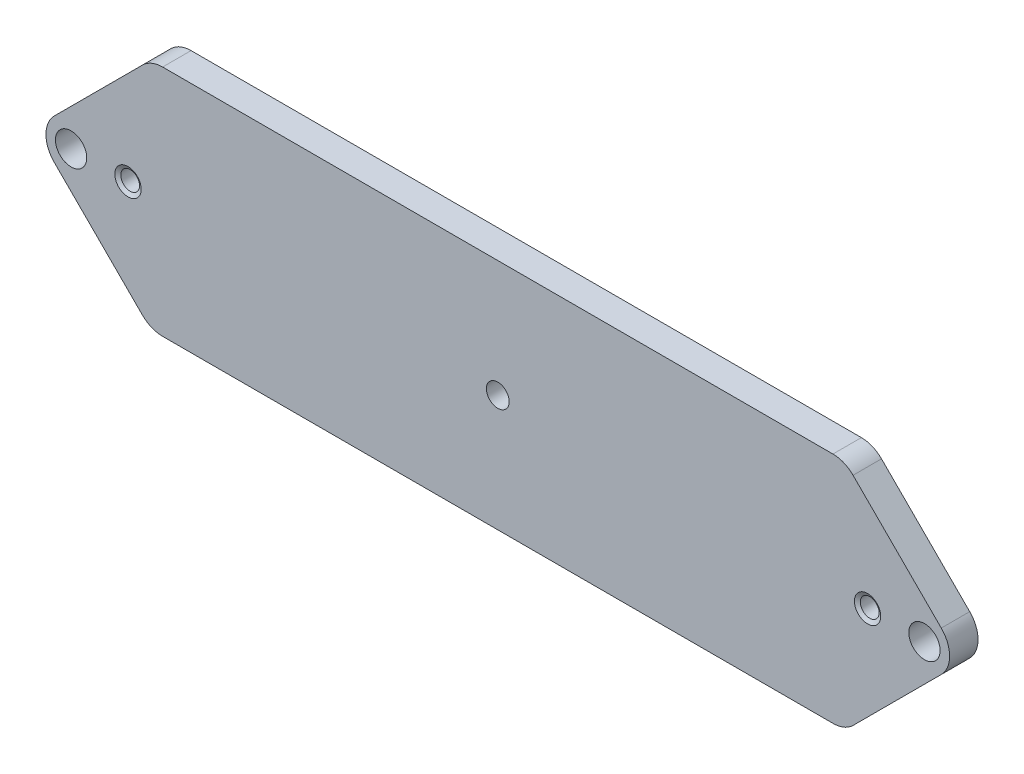
ISO-10303-21;
HEADER;
FILE_DESCRIPTION(('STEP AP214'),'2;1');
FILE_NAME('part.step','',(''),(''),'','','');
FILE_SCHEMA(('AUTOMOTIVE_DESIGN { 1 0 10303 214 1 1 1 1 }'));
ENDSEC;
DATA;
#1=APPLICATION_CONTEXT('core data for automotive mechanical design processes');
#2=APPLICATION_PROTOCOL_DEFINITION('international standard','automotive_design',2000,#1);
#3=PRODUCT_CONTEXT('',#1,'mechanical');
#4=PRODUCT('Part','Part','',(#3));
#5=PRODUCT_RELATED_PRODUCT_CATEGORY('part','',(#4));
#6=PRODUCT_DEFINITION_FORMATION('','',#4);
#7=PRODUCT_DEFINITION_CONTEXT('part definition',#1,'design');
#8=PRODUCT_DEFINITION('design','',#6,#7);
#9=PRODUCT_DEFINITION_SHAPE('','',#8);
#10=(LENGTH_UNIT() NAMED_UNIT(*) SI_UNIT(.MILLI.,.METRE.));
#11=(NAMED_UNIT(*) PLANE_ANGLE_UNIT() SI_UNIT($,.RADIAN.));
#12=(NAMED_UNIT(*) SI_UNIT($,.STERADIAN.) SOLID_ANGLE_UNIT());
#13=UNCERTAINTY_MEASURE_WITH_UNIT(LENGTH_MEASURE(1.E-05),#10,'distance_accuracy_value','');
#14=(GEOMETRIC_REPRESENTATION_CONTEXT(3) GLOBAL_UNCERTAINTY_ASSIGNED_CONTEXT((#13)) GLOBAL_UNIT_ASSIGNED_CONTEXT((#10,
#11,#12)) REPRESENTATION_CONTEXT('',''));
#15=CARTESIAN_POINT('',(0.,0.,0.));
#16=DIRECTION('',(0.,0.,1.));
#17=DIRECTION('',(1.,0.,0.));
#18=AXIS2_PLACEMENT_3D('',#15,#16,#17);
#19=CARTESIAN_POINT('',(12.9999997502345,20.5000001922363,-4.99999999999926));
#20=DIRECTION('',(-1.62601148525812E-12,0.,-1.));
#21=DIRECTION('',(-1.,0.,1.62601148525812E-12));
#22=AXIS2_PLACEMENT_3D('',#19,#20,#21);
#23=CONICAL_SURFACE('',#22,2.34282032309282,1.04719755118823);
#24=CARTESIAN_POINT('',(12.9999997502352,20.5000001922363,-4.6));
#25=DIRECTION('',(1.62349948480515E-12,0.,1.));
#26=DIRECTION('',(1.,0.,-1.62349948480515E-12));
#27=AXIS2_PLACEMENT_3D('',#24,#25,#26);
#28=CIRCLE('',#27,1.65);
#29=CARTESIAN_POINT('',(14.6499997502352,20.5000001922363,-4.60000000000268));
#30=VERTEX_POINT('',#29);
#31=EDGE_CURVE('E165',#30,#30,#28,.T.);
#32=ORIENTED_EDGE('',*,*,#31,.T.);
#33=EDGE_LOOP('',(#32));
#34=FACE_BOUND('',#33,.T.);
#35=CARTESIAN_POINT('',(12.9999997502345,20.5000001922363,-4.99999999998326));
#36=DIRECTION('',(-1.62601148525812E-12,0.,-1.));
#37=DIRECTION('',(-1.,0.,1.62601148525812E-12));
#38=AXIS2_PLACEMENT_3D('',#35,#36,#37);
#39=CIRCLE('',#38,2.3428203230651);
#40=CARTESIAN_POINT('',(10.6571794271695,20.5000001922363,-4.99999999997945));
#41=VERTEX_POINT('',#40);
#42=EDGE_CURVE('E20',#41,#41,#39,.T.);
#43=ORIENTED_EDGE('',*,*,#42,.T.);
#44=EDGE_LOOP('',(#43));
#45=FACE_BOUND('',#44,.T.);
#46=ADVANCED_FACE('F17',(#34,#45),#23,.F.);
#47=CARTESIAN_POINT('',(142.99999962194,20.5000001922363,-5.00000000011298));
#48=DIRECTION('',(-1.64082033294538E-12,0.,-1.));
#49=DIRECTION('',(-1.,0.,1.64082033294538E-12));
#50=AXIS2_PLACEMENT_3D('',#47,#48,#49);
#51=CONICAL_SURFACE('',#50,2.34282032321242,1.04719755120725);
#52=CARTESIAN_POINT('',(142.999999621942,20.5000001922363,-4.60000000000002));
#53=DIRECTION('',(1.62349948480515E-12,0.,1.));
#54=DIRECTION('',(1.,0.,-1.62349948480515E-12));
#55=AXIS2_PLACEMENT_3D('',#52,#53,#54);
#56=CIRCLE('',#55,1.65);
#57=CARTESIAN_POINT('',(144.649999621942,20.5000001922363,-4.6000000000027));
#58=VERTEX_POINT('',#57);
#59=EDGE_CURVE('E162',#58,#58,#56,.T.);
#60=ORIENTED_EDGE('',*,*,#59,.T.);
#61=EDGE_LOOP('',(#60));
#62=FACE_BOUND('',#61,.T.);
#63=CARTESIAN_POINT('',(142.99999962194,20.5000001922363,-5.00000000022484));
#64=DIRECTION('',(-1.64082033294538E-12,0.,-1.));
#65=DIRECTION('',(-1.,0.,1.64082033294538E-12));
#66=AXIS2_PLACEMENT_3D('',#63,#64,#65);
#67=CIRCLE('',#66,2.34282032340616);
#68=CARTESIAN_POINT('',(140.657179298534,20.5000001922363,-5.00000000022099));
#69=VERTEX_POINT('',#68);
#70=EDGE_CURVE('E150',#69,#69,#67,.T.);
#71=ORIENTED_EDGE('',*,*,#70,.T.);
#72=EDGE_LOOP('',(#71));
#73=FACE_BOUND('',#72,.T.);
#74=ADVANCED_FACE('F434',(#62,#73),#51,.F.);
#75=CARTESIAN_POINT('',(12.9999997502427,20.5000001922363,0.));
#76=DIRECTION('',(1.62349948480515E-12,0.,1.));
#77=DIRECTION('',(1.,0.,-1.62349948480515E-12));
#78=AXIS2_PLACEMENT_3D('',#75,#76,#77);
#79=CYLINDRICAL_SURFACE('',#78,1.65);
#80=CARTESIAN_POINT('',(12.9999997502421,20.5000001922363,-0.383937929083962));
#81=DIRECTION('',(1.62414593923887E-12,0.,1.));
#82=DIRECTION('',(1.,0.,-1.62413485437808E-12));
#83=AXIS2_PLACEMENT_3D('',#80,#81,#82);
#84=CIRCLE('',#83,1.65000000000529);
#85=CARTESIAN_POINT('',(14.6499997502474,20.5000001922363,-0.383937929086642));
#86=VERTEX_POINT('',#85);
#87=EDGE_CURVE('E141',#86,#86,#84,.T.);
#88=ORIENTED_EDGE('',*,*,#87,.T.);
#89=EDGE_LOOP('',(#88));
#90=FACE_BOUND('',#89,.T.);
#91=ORIENTED_EDGE('',*,*,#31,.F.);
#92=EDGE_LOOP('',(#91));
#93=FACE_BOUND('',#92,.T.);
#94=ADVANCED_FACE('F236',(#90,#93),#79,.F.);
#95=CARTESIAN_POINT('',(142.999999621949,20.5000001922363,0.));
#96=DIRECTION('',(1.62349948480515E-12,0.,1.));
#97=DIRECTION('',(1.,0.,-1.62349948480515E-12));
#98=AXIS2_PLACEMENT_3D('',#95,#96,#97);
#99=CYLINDRICAL_SURFACE('',#98,1.65);
#100=CARTESIAN_POINT('',(142.999999621948,20.5000001922363,-0.383937929027091));
#101=DIRECTION('',(1.64092815904728E-12,0.,1.));
#102=DIRECTION('',(1.,0.,-1.64095641536322E-12));
#103=AXIS2_PLACEMENT_3D('',#100,#101,#102);
#104=CIRCLE('',#103,1.64999999999924);
#105=CARTESIAN_POINT('',(144.649999621947,20.5000001922363,-0.383937929029798));
#106=VERTEX_POINT('',#105);
#107=EDGE_CURVE('E136',#106,#106,#104,.T.);
#108=ORIENTED_EDGE('',*,*,#107,.T.);
#109=EDGE_LOOP('',(#108));
#110=FACE_BOUND('',#109,.T.);
#111=ORIENTED_EDGE('',*,*,#59,.F.);
#112=EDGE_LOOP('',(#111));
#113=FACE_BOUND('',#112,.T.);
#114=ADVANCED_FACE('F227',(#110,#113),#99,.F.);
#115=CARTESIAN_POINT('',(0.,0.,-5.));
#116=DIRECTION('',(0.,0.,1.));
#117=DIRECTION('',(1.,0.,0.));
#118=AXIS2_PLACEMENT_3D('',#115,#116,#117);
#119=PLANE('',#118);
#120=CARTESIAN_POINT('',(152.999999372191,20.4919259853408,-5.));
#121=DIRECTION('',(0.,0.,-1.));
#122=DIRECTION('',(-1.,0.,0.));
#123=AXIS2_PLACEMENT_3D('',#120,#121,#122);
#124=CIRCLE('',#123,2.75);
#125=CARTESIAN_POINT('',(150.249999372191,20.4919259853408,-5.));
#126=VERTEX_POINT('',#125);
#127=EDGE_CURVE('E139',#126,#126,#124,.F.);
#128=ORIENTED_EDGE('',*,*,#127,.T.);
#129=EDGE_LOOP('',(#128));
#130=FACE_BOUND('',#129,.T.);
#131=ORIENTED_EDGE('',*,*,#70,.F.);
#132=EDGE_LOOP('',(#131));
#133=FACE_BOUND('',#132,.T.);
#134=CARTESIAN_POINT('',(2.99999999999994,20.4919259853408,-5.));
#135=DIRECTION('',(0.,0.,1.));
#136=DIRECTION('',(1.,0.,0.));
#137=AXIS2_PLACEMENT_3D('',#134,#135,#136);
#138=CIRCLE('',#137,2.75);
#139=CARTESIAN_POINT('',(5.74999999999994,20.4919259853408,-5.));
#140=VERTEX_POINT('',#139);
#141=EDGE_CURVE('E140',#140,#140,#138,.T.);
#142=ORIENTED_EDGE('',*,*,#141,.T.);
#143=EDGE_LOOP('',(#142));
#144=FACE_BOUND('',#143,.T.);
#145=CARTESIAN_POINT('',(78.,20.5,-5.));
#146=DIRECTION('',(0.,0.,1.));
#147=DIRECTION('',(1.,0.,0.));
#148=AXIS2_PLACEMENT_3D('',#145,#146,#147);
#149=CIRCLE('',#148,2.);
#150=CARTESIAN_POINT('',(80.,20.5,-5.));
#151=VERTEX_POINT('',#150);
#152=EDGE_CURVE('E144',#151,#151,#149,.T.);
#153=ORIENTED_EDGE('',*,*,#152,.T.);
#154=EDGE_LOOP('',(#153));
#155=FACE_BOUND('',#154,.T.);
#156=ORIENTED_EDGE('',*,*,#42,.F.);
#157=EDGE_LOOP('',(#156));
#158=FACE_BOUND('',#157,.T.);
#159=CARTESIAN_POINT('',(136.928931560326,5.,-5.));
#160=DIRECTION('',(0.,0.,-1.));
#161=DIRECTION('',(-1.,0.,0.));
#162=AXIS2_PLACEMENT_3D('',#159,#160,#161);
#163=CIRCLE('',#162,5.);
#164=CARTESIAN_POINT('',(136.928931560326,0.,-5.));
#165=VERTEX_POINT('',#164);
#166=CARTESIAN_POINT('',(140.464465466259,1.46446609406714,-5.));
#167=VERTEX_POINT('',#166);
#168=EDGE_CURVE('E148',#165,#167,#163,.F.);
#169=ORIENTED_EDGE('',*,*,#168,.F.);
#170=DIRECTION('',(1.,0.,0.));
#171=VECTOR('',#170,1.);
#172=CARTESIAN_POINT('',(0.,0.,-5.));
#173=LINE('',#172,#171);
#174=CARTESIAN_POINT('',(19.0710678118654,0.,-5.));
#175=VERTEX_POINT('',#174);
#176=EDGE_CURVE('E151',#175,#165,#173,.T.);
#177=ORIENTED_EDGE('',*,*,#176,.F.);
#178=CARTESIAN_POINT('',(19.0710678118654,5.,-5.));
#179=DIRECTION('',(0.,0.,1.));
#180=DIRECTION('',(1.,0.,0.));
#181=AXIS2_PLACEMENT_3D('',#178,#179,#180);
#182=CIRCLE('',#181,5.);
#183=CARTESIAN_POINT('',(15.5355339059327,1.46446609406727,-5.));
#184=VERTEX_POINT('',#183);
#185=EDGE_CURVE('E212',#184,#175,#182,.T.);
#186=ORIENTED_EDGE('',*,*,#185,.F.);
#187=DIRECTION('',(-0.707106781186547,0.707106781186548,0.));
#188=VECTOR('',#187,1.);
#189=CARTESIAN_POINT('',(-3.49192598534078,20.4919259853408,-5.));
#190=LINE('',#189,#188);
#191=CARTESIAN_POINT('',(0.0436079205919705,16.956392079408,-5.));
#192=VERTEX_POINT('',#191);
#193=EDGE_CURVE('E155',#184,#192,#190,.T.);
#194=ORIENTED_EDGE('',*,*,#193,.T.);
#195=CARTESIAN_POINT('',(3.5791418265247,20.4919259853408,-5.));
#196=DIRECTION('',(0.,0.,1.));
#197=DIRECTION('',(0.,-1.,0.));
#198=AXIS2_PLACEMENT_3D('',#195,#196,#197);
#199=CIRCLE('',#198,5.);
#200=CARTESIAN_POINT('',(0.0436079205919661,24.0274598912735,-5.));
#201=VERTEX_POINT('',#200);
#202=EDGE_CURVE('E158',#201,#192,#199,.T.);
#203=ORIENTED_EDGE('',*,*,#202,.F.);
#204=DIRECTION('',(0.707106781186548,0.707106781186547,0.));
#205=VECTOR('',#204,1.);
#206=CARTESIAN_POINT('',(20.4952983673943,44.4791503380758,-5.));
#207=LINE('',#206,#205);
#208=CARTESIAN_POINT('',(15.5516819352512,39.5355339059327,-5.));
#209=VERTEX_POINT('',#208);
#210=EDGE_CURVE('E159',#201,#209,#207,.T.);
#211=ORIENTED_EDGE('',*,*,#210,.T.);
#212=CARTESIAN_POINT('',(19.087215841184,36.,-5.));
#213=DIRECTION('',(0.,0.,-1.));
#214=DIRECTION('',(-1.,0.,0.));
#215=AXIS2_PLACEMENT_3D('',#212,#213,#214);
#216=CIRCLE('',#215,5.);
#217=CARTESIAN_POINT('',(19.087215841184,41.,-5.));
#218=VERTEX_POINT('',#217);
#219=EDGE_CURVE('E122',#218,#209,#216,.F.);
#220=ORIENTED_EDGE('',*,*,#219,.F.);
#221=DIRECTION('',(1.,0.,0.));
#222=VECTOR('',#221,1.);
#223=CARTESIAN_POINT('',(156.,41.,-5.));
#224=LINE('',#223,#222);
#225=CARTESIAN_POINT('',(136.912783531007,41.,-5.));
#226=VERTEX_POINT('',#225);
#227=EDGE_CURVE('E118',#226,#218,#224,.F.);
#228=ORIENTED_EDGE('',*,*,#227,.F.);
#229=CARTESIAN_POINT('',(136.912783531007,36.,-5.));
#230=DIRECTION('',(0.,0.,1.));
#231=DIRECTION('',(1.,0.,0.));
#232=AXIS2_PLACEMENT_3D('',#229,#230,#231);
#233=CIRCLE('',#232,5.);
#234=CARTESIAN_POINT('',(140.44831743694,39.5355339059327,-5.));
#235=VERTEX_POINT('',#234);
#236=EDGE_CURVE('E107',#235,#226,#233,.T.);
#237=ORIENTED_EDGE('',*,*,#236,.F.);
#238=DIRECTION('',(0.707106781186548,-0.707106781186547,0.));
#239=VECTOR('',#238,1.);
#240=CARTESIAN_POINT('',(159.491925357532,20.4919259853408,-5.));
#241=LINE('',#240,#239);
#242=CARTESIAN_POINT('',(155.956391451599,24.0274598912735,-5.));
#243=VERTEX_POINT('',#242);
#244=EDGE_CURVE('E102',#235,#243,#241,.T.);
#245=ORIENTED_EDGE('',*,*,#244,.T.);
#246=CARTESIAN_POINT('',(152.420857545667,20.4919259853407,-5.));
#247=DIRECTION('',(0.,0.,-1.));
#248=DIRECTION('',(0.,1.,0.));
#249=AXIS2_PLACEMENT_3D('',#246,#247,#248);
#250=CIRCLE('',#249,5.);
#251=CARTESIAN_POINT('',(155.9563914516,16.9563920794078,-5.));
#252=VERTEX_POINT('',#251);
#253=EDGE_CURVE('E207',#252,#243,#250,.F.);
#254=ORIENTED_EDGE('',*,*,#253,.F.);
#255=DIRECTION('',(-0.707106781186547,-0.707106781186548,0.));
#256=VECTOR('',#255,1.);
#257=CARTESIAN_POINT('',(134.456841332806,-4.54315803938587,-5.));
#258=LINE('',#257,#256);
#259=EDGE_CURVE('E145',#252,#167,#258,.T.);
#260=ORIENTED_EDGE('',*,*,#259,.T.);
#261=EDGE_LOOP('',(#169,#177,#186,#194,#203,#211,#220,#228,#237,#245,#254,#260));
#262=FACE_BOUND('',#261,.T.);
#263=ADVANCED_FACE('F120',(#130,#133,#144,#155,#158,#262),#119,.F.);
#264=CARTESIAN_POINT('',(159.491925357532,20.4919259853408,-5.50000240026235));
#265=DIRECTION('',(-0.707106781186547,-0.707106781186548,0.));
#266=DIRECTION('',(0.707106781186548,-0.707106781186547,0.));
#267=AXIS2_PLACEMENT_3D('',#264,#265,#266);
#268=PLANE('',#267);
#269=ORIENTED_EDGE('',*,*,#244,.F.);
#270=DIRECTION('',(0.,0.,1.));
#271=VECTOR('',#270,1.);
#272=CARTESIAN_POINT('',(140.44831743694,39.5355339059326,0.));
#273=LINE('',#272,#271);
#274=CARTESIAN_POINT('',(140.44831743694,39.5355339059327,0.));
#275=VERTEX_POINT('',#274);
#276=EDGE_CURVE('E114',#275,#235,#273,.F.);
#277=ORIENTED_EDGE('',*,*,#276,.F.);
#278=DIRECTION('',(-0.707106781186542,0.707106781186553,0.));
#279=VECTOR('',#278,1.);
#280=CARTESIAN_POINT('',(155.956391451599,24.0274598912735,0.));
#281=LINE('',#280,#279);
#282=CARTESIAN_POINT('',(155.956391451599,24.0274598912735,0.));
#283=VERTEX_POINT('',#282);
#284=EDGE_CURVE('E200',#283,#275,#281,.T.);
#285=ORIENTED_EDGE('',*,*,#284,.F.);
#286=DIRECTION('',(0.,0.,-1.));
#287=VECTOR('',#286,1.);
#288=CARTESIAN_POINT('',(155.956391451599,24.0274598912738,0.));
#289=LINE('',#288,#287);
#290=EDGE_CURVE('E473',#243,#283,#289,.F.);
#291=ORIENTED_EDGE('',*,*,#290,.F.);
#292=EDGE_LOOP('',(#269,#277,#285,#291));
#293=FACE_BOUND('',#292,.T.);
#294=ADVANCED_FACE('F226',(#293),#268,.F.);
#295=CARTESIAN_POINT('',(136.912783531007,36.,0.));
#296=DIRECTION('',(0.,0.,1.));
#297=DIRECTION('',(1.,0.,0.));
#298=AXIS2_PLACEMENT_3D('',#295,#296,#297);
#299=CYLINDRICAL_SURFACE('',#298,5.);
#300=DIRECTION('',(0.,0.,1.));
#301=VECTOR('',#300,1.);
#302=CARTESIAN_POINT('',(136.912783531007,41.,0.));
#303=LINE('',#302,#301);
#304=CARTESIAN_POINT('',(136.912783531007,41.,0.));
#305=VERTEX_POINT('',#304);
#306=EDGE_CURVE('E112',#305,#226,#303,.F.);
#307=ORIENTED_EDGE('',*,*,#306,.F.);
#308=CARTESIAN_POINT('',(136.912783531007,36.,0.));
#309=DIRECTION('',(0.,0.,1.));
#310=DIRECTION('',(1.,0.,0.));
#311=AXIS2_PLACEMENT_3D('',#308,#309,#310);
#312=CIRCLE('',#311,5.);
#313=EDGE_CURVE('E198',#275,#305,#312,.T.);
#314=ORIENTED_EDGE('',*,*,#313,.F.);
#315=ORIENTED_EDGE('',*,*,#276,.T.);
#316=ORIENTED_EDGE('',*,*,#236,.T.);
#317=EDGE_LOOP('',(#307,#314,#315,#316));
#318=FACE_BOUND('',#317,.T.);
#319=ADVANCED_FACE('F109',(#318),#299,.T.);
#320=CARTESIAN_POINT('',(156.,41.,0.));
#321=DIRECTION('',(0.,1.,0.));
#322=DIRECTION('',(0.,0.,1.));
#323=AXIS2_PLACEMENT_3D('',#320,#321,#322);
#324=PLANE('',#323);
#325=ORIENTED_EDGE('',*,*,#306,.T.);
#326=ORIENTED_EDGE('',*,*,#227,.T.);
#327=DIRECTION('',(0.,0.,-1.));
#328=VECTOR('',#327,1.);
#329=CARTESIAN_POINT('',(19.087215841184,41.,0.));
#330=LINE('',#329,#328);
#331=CARTESIAN_POINT('',(19.087215841184,41.,0.));
#332=VERTEX_POINT('',#331);
#333=EDGE_CURVE('E125',#332,#218,#330,.T.);
#334=ORIENTED_EDGE('',*,*,#333,.F.);
#335=DIRECTION('',(1.,0.,0.));
#336=VECTOR('',#335,1.);
#337=CARTESIAN_POINT('',(0.,41.,0.));
#338=LINE('',#337,#336);
#339=EDGE_CURVE('E129',#305,#332,#338,.F.);
#340=ORIENTED_EDGE('',*,*,#339,.F.);
#341=EDGE_LOOP('',(#325,#326,#334,#340));
#342=FACE_BOUND('',#341,.T.);
#343=ADVANCED_FACE('F127',(#342),#324,.T.);
#344=CARTESIAN_POINT('',(19.087215841184,36.,0.));
#345=DIRECTION('',(0.,0.,-1.));
#346=DIRECTION('',(-1.,0.,0.));
#347=AXIS2_PLACEMENT_3D('',#344,#345,#346);
#348=CYLINDRICAL_SURFACE('',#347,5.);
#349=ORIENTED_EDGE('',*,*,#333,.T.);
#350=ORIENTED_EDGE('',*,*,#219,.T.);
#351=DIRECTION('',(0.,0.,1.));
#352=VECTOR('',#351,1.);
#353=CARTESIAN_POINT('',(15.5516819352512,39.5355339059327,-5.50000240026235));
#354=LINE('',#353,#352);
#355=CARTESIAN_POINT('',(15.5516819352512,39.5355339059327,0.));
#356=VERTEX_POINT('',#355);
#357=EDGE_CURVE('E160',#209,#356,#354,.T.);
#358=ORIENTED_EDGE('',*,*,#357,.T.);
#359=CARTESIAN_POINT('',(19.087215841184,36.,0.));
#360=DIRECTION('',(0.,0.,-1.));
#361=DIRECTION('',(-1.,0.,0.));
#362=AXIS2_PLACEMENT_3D('',#359,#360,#361);
#363=CIRCLE('',#362,5.);
#364=EDGE_CURVE('E195',#332,#356,#363,.F.);
#365=ORIENTED_EDGE('',*,*,#364,.F.);
#366=EDGE_LOOP('',(#349,#350,#358,#365));
#367=FACE_BOUND('',#366,.T.);
#368=ADVANCED_FACE('F298',(#367),#348,.T.);
#369=CARTESIAN_POINT('',(20.4952983673943,44.4791503380758,-5.50000240026235));
#370=DIRECTION('',(0.707106781186547,-0.707106781186548,0.));
#371=DIRECTION('',(0.707106781186548,0.707106781186547,0.));
#372=AXIS2_PLACEMENT_3D('',#369,#370,#371);
#373=PLANE('',#372);
#374=DIRECTION('',(-0.707106781186548,-0.707106781186547,0.));
#375=VECTOR('',#374,1.);
#376=CARTESIAN_POINT('',(15.5516819352512,39.5355339059327,0.));
#377=LINE('',#376,#375);
#378=CARTESIAN_POINT('',(0.0436079205919648,24.0274598912735,0.));
#379=VERTEX_POINT('',#378);
#380=EDGE_CURVE('E194',#356,#379,#377,.T.);
#381=ORIENTED_EDGE('',*,*,#380,.F.);
#382=ORIENTED_EDGE('',*,*,#357,.F.);
#383=ORIENTED_EDGE('',*,*,#210,.F.);
#384=DIRECTION('',(0.,0.,1.));
#385=VECTOR('',#384,1.);
#386=CARTESIAN_POINT('',(0.0436079205919444,24.0274598912735,0.));
#387=LINE('',#386,#385);
#388=EDGE_CURVE('E217',#379,#201,#387,.F.);
#389=ORIENTED_EDGE('',*,*,#388,.F.);
#390=EDGE_LOOP('',(#381,#382,#383,#389));
#391=FACE_BOUND('',#390,.T.);
#392=ADVANCED_FACE('F294',(#391),#373,.F.);
#393=CARTESIAN_POINT('',(3.5791418265247,20.4919259853408,0.));
#394=DIRECTION('',(0.,0.,1.));
#395=DIRECTION('',(0.,-1.,0.));
#396=AXIS2_PLACEMENT_3D('',#393,#394,#395);
#397=CYLINDRICAL_SURFACE('',#396,5.);
#398=DIRECTION('',(0.,0.,1.));
#399=VECTOR('',#398,1.);
#400=CARTESIAN_POINT('',(0.0436079205919856,16.956392079408,-5.50000240026235));
#401=LINE('',#400,#399);
#402=CARTESIAN_POINT('',(0.0436079205919581,16.956392079408,0.));
#403=VERTEX_POINT('',#402);
#404=EDGE_CURVE('E157',#192,#403,#401,.T.);
#405=ORIENTED_EDGE('',*,*,#404,.T.);
#406=CARTESIAN_POINT('',(3.5791418265247,20.4919259853408,0.));
#407=DIRECTION('',(0.,0.,1.));
#408=DIRECTION('',(0.,-1.,0.));
#409=AXIS2_PLACEMENT_3D('',#406,#407,#408);
#410=CIRCLE('',#409,5.);
#411=EDGE_CURVE('E191',#379,#403,#410,.T.);
#412=ORIENTED_EDGE('',*,*,#411,.F.);
#413=ORIENTED_EDGE('',*,*,#388,.T.);
#414=ORIENTED_EDGE('',*,*,#202,.T.);
#415=EDGE_LOOP('',(#405,#412,#413,#414));
#416=FACE_BOUND('',#415,.T.);
#417=ADVANCED_FACE('F290',(#416),#397,.T.);
#418=CARTESIAN_POINT('',(-3.49192598534078,20.4919259853408,-5.50000240026235));
#419=DIRECTION('',(0.707106781186548,0.707106781186547,0.));
#420=DIRECTION('',(-0.707106781186547,0.707106781186548,0.));
#421=AXIS2_PLACEMENT_3D('',#418,#419,#420);
#422=PLANE('',#421);
#423=DIRECTION('',(0.707106781186548,-0.707106781186547,0.));
#424=VECTOR('',#423,1.);
#425=CARTESIAN_POINT('',(0.0436079205919579,16.956392079408,0.));
#426=LINE('',#425,#424);
#427=CARTESIAN_POINT('',(15.5355339059327,1.46446609406726,0.));
#428=VERTEX_POINT('',#427);
#429=EDGE_CURVE('E190',#403,#428,#426,.T.);
#430=ORIENTED_EDGE('',*,*,#429,.F.);
#431=ORIENTED_EDGE('',*,*,#404,.F.);
#432=ORIENTED_EDGE('',*,*,#193,.F.);
#433=DIRECTION('',(0.,0.,1.));
#434=VECTOR('',#433,1.);
#435=CARTESIAN_POINT('',(15.5355339059327,1.46446609406724,0.));
#436=LINE('',#435,#434);
#437=EDGE_CURVE('E214',#428,#184,#436,.F.);
#438=ORIENTED_EDGE('',*,*,#437,.F.);
#439=EDGE_LOOP('',(#430,#431,#432,#438));
#440=FACE_BOUND('',#439,.T.);
#441=ADVANCED_FACE('F286',(#440),#422,.F.);
#442=CARTESIAN_POINT('',(19.0710678118654,5.,0.));
#443=DIRECTION('',(0.,0.,1.));
#444=DIRECTION('',(1.,0.,0.));
#445=AXIS2_PLACEMENT_3D('',#442,#443,#444);
#446=CYLINDRICAL_SURFACE('',#445,5.);
#447=DIRECTION('',(0.,0.,-1.));
#448=VECTOR('',#447,1.);
#449=CARTESIAN_POINT('',(19.0710678118654,0.,0.));
#450=LINE('',#449,#448);
#451=CARTESIAN_POINT('',(19.0710678118654,0.,0.));
#452=VERTEX_POINT('',#451);
#453=EDGE_CURVE('E154',#452,#175,#450,.T.);
#454=ORIENTED_EDGE('',*,*,#453,.F.);
#455=CARTESIAN_POINT('',(19.0710678118654,5.,0.));
#456=DIRECTION('',(0.,0.,1.));
#457=DIRECTION('',(1.,0.,0.));
#458=AXIS2_PLACEMENT_3D('',#455,#456,#457);
#459=CIRCLE('',#458,5.);
#460=EDGE_CURVE('E187',#428,#452,#459,.T.);
#461=ORIENTED_EDGE('',*,*,#460,.F.);
#462=ORIENTED_EDGE('',*,*,#437,.T.);
#463=ORIENTED_EDGE('',*,*,#185,.T.);
#464=EDGE_LOOP('',(#454,#461,#462,#463));
#465=FACE_BOUND('',#464,.T.);
#466=ADVANCED_FACE('F282',(#465),#446,.T.);
#467=CARTESIAN_POINT('',(0.,0.,0.));
#468=DIRECTION('',(0.,-1.,0.));
#469=DIRECTION('',(0.,0.,-1.));
#470=AXIS2_PLACEMENT_3D('',#467,#468,#469);
#471=PLANE('',#470);
#472=DIRECTION('',(0.,0.,-1.));
#473=VECTOR('',#472,1.);
#474=CARTESIAN_POINT('',(136.928931560326,0.,0.));
#475=LINE('',#474,#473);
#476=CARTESIAN_POINT('',(136.928931560326,0.,0.));
#477=VERTEX_POINT('',#476);
#478=EDGE_CURVE('E153',#477,#165,#475,.T.);
#479=ORIENTED_EDGE('',*,*,#478,.F.);
#480=DIRECTION('',(1.,0.,0.));
#481=VECTOR('',#480,1.);
#482=CARTESIAN_POINT('',(0.,0.,0.));
#483=LINE('',#482,#481);
#484=EDGE_CURVE('E186',#452,#477,#483,.T.);
#485=ORIENTED_EDGE('',*,*,#484,.F.);
#486=ORIENTED_EDGE('',*,*,#453,.T.);
#487=ORIENTED_EDGE('',*,*,#176,.T.);
#488=EDGE_LOOP('',(#479,#485,#486,#487));
#489=FACE_BOUND('',#488,.T.);
#490=ADVANCED_FACE('F278',(#489),#471,.T.);
#491=CARTESIAN_POINT('',(136.928931560326,5.,0.));
#492=DIRECTION('',(0.,0.,-1.));
#493=DIRECTION('',(-1.,0.,0.));
#494=AXIS2_PLACEMENT_3D('',#491,#492,#493);
#495=CYLINDRICAL_SURFACE('',#494,5.);
#496=ORIENTED_EDGE('',*,*,#478,.T.);
#497=ORIENTED_EDGE('',*,*,#168,.T.);
#498=DIRECTION('',(0.,0.,1.));
#499=VECTOR('',#498,1.);
#500=CARTESIAN_POINT('',(140.464465466259,1.46446609406721,-5.50000240026235));
#501=LINE('',#500,#499);
#502=CARTESIAN_POINT('',(140.464465466259,1.46446609406721,0.));
#503=VERTEX_POINT('',#502);
#504=EDGE_CURVE('E147',#167,#503,#501,.T.);
#505=ORIENTED_EDGE('',*,*,#504,.T.);
#506=CARTESIAN_POINT('',(136.928931560326,5.,0.));
#507=DIRECTION('',(0.,0.,-1.));
#508=DIRECTION('',(-1.,0.,0.));
#509=AXIS2_PLACEMENT_3D('',#506,#507,#508);
#510=CIRCLE('',#509,5.);
#511=EDGE_CURVE('E183',#477,#503,#510,.F.);
#512=ORIENTED_EDGE('',*,*,#511,.F.);
#513=EDGE_LOOP('',(#496,#497,#505,#512));
#514=FACE_BOUND('',#513,.T.);
#515=ADVANCED_FACE('F275',(#514),#495,.T.);
#516=CARTESIAN_POINT('',(134.456841332806,-4.54315803938587,-5.50000240026235));
#517=DIRECTION('',(-0.707106781186548,0.707106781186547,0.));
#518=DIRECTION('',(-0.707106781186547,-0.707106781186548,0.));
#519=AXIS2_PLACEMENT_3D('',#516,#517,#518);
#520=PLANE('',#519);
#521=ORIENTED_EDGE('',*,*,#259,.F.);
#522=DIRECTION('',(0.,0.,-1.));
#523=VECTOR('',#522,1.);
#524=CARTESIAN_POINT('',(155.956391451599,16.9563920794076,0.));
#525=LINE('',#524,#523);
#526=CARTESIAN_POINT('',(155.956391451599,16.956392079408,0.));
#527=VERTEX_POINT('',#526);
#528=EDGE_CURVE('E35',#527,#252,#525,.T.);
#529=ORIENTED_EDGE('',*,*,#528,.F.);
#530=DIRECTION('',(0.70710678118653,0.707106781186565,0.));
#531=VECTOR('',#530,1.);
#532=CARTESIAN_POINT('',(140.464465466259,1.46446609406726,0.));
#533=LINE('',#532,#531);
#534=EDGE_CURVE('E182',#503,#527,#533,.T.);
#535=ORIENTED_EDGE('',*,*,#534,.F.);
#536=ORIENTED_EDGE('',*,*,#504,.F.);
#537=EDGE_LOOP('',(#521,#529,#535,#536));
#538=FACE_BOUND('',#537,.T.);
#539=ADVANCED_FACE('F271',(#538),#520,.F.);
#540=CARTESIAN_POINT('',(152.420857545667,20.4919259853407,0.));
#541=DIRECTION('',(0.,0.,-1.));
#542=DIRECTION('',(0.,1.,0.));
#543=AXIS2_PLACEMENT_3D('',#540,#541,#542);
#544=CYLINDRICAL_SURFACE('',#543,5.);
#545=ORIENTED_EDGE('',*,*,#528,.T.);
#546=ORIENTED_EDGE('',*,*,#253,.T.);
#547=ORIENTED_EDGE('',*,*,#290,.T.);
#548=CARTESIAN_POINT('',(152.420857545667,20.4919259853407,0.));
#549=DIRECTION('',(0.,0.,-1.));
#550=DIRECTION('',(0.,1.,0.));
#551=AXIS2_PLACEMENT_3D('',#548,#549,#550);
#552=CIRCLE('',#551,5.);
#553=EDGE_CURVE('E179',#527,#283,#552,.F.);
#554=ORIENTED_EDGE('',*,*,#553,.F.);
#555=EDGE_LOOP('',(#545,#546,#547,#554));
#556=FACE_BOUND('',#555,.T.);
#557=ADVANCED_FACE('F267',(#556),#544,.T.);
#558=CARTESIAN_POINT('',(78.,20.5,-5.5000024));
#559=DIRECTION('',(0.,0.,1.));
#560=DIRECTION('',(1.,0.,0.));
#561=AXIS2_PLACEMENT_3D('',#558,#559,#560);
#562=CYLINDRICAL_SURFACE('',#561,2.);
#563=CARTESIAN_POINT('',(78.,20.5,0.));
#564=DIRECTION('',(0.,0.,1.));
#565=DIRECTION('',(1.,0.,0.));
#566=AXIS2_PLACEMENT_3D('',#563,#564,#565);
#567=CIRCLE('',#566,2.);
#568=CARTESIAN_POINT('',(80.,20.5,0.));
#569=VERTEX_POINT('',#568);
#570=EDGE_CURVE('E176',#569,#569,#567,.F.);
#571=ORIENTED_EDGE('',*,*,#570,.F.);
#572=EDGE_LOOP('',(#571));
#573=FACE_BOUND('',#572,.T.);
#574=ORIENTED_EDGE('',*,*,#152,.F.);
#575=EDGE_LOOP('',(#574));
#576=FACE_BOUND('',#575,.T.);
#577=ADVANCED_FACE('F263',(#573,#576),#562,.F.);
#578=CARTESIAN_POINT('',(12.9999997502427,20.5000001922363,-1.09927013015274E-10));
#579=DIRECTION('',(1.62411434401029E-12,0.,1.));
#580=DIRECTION('',(1.,0.,-1.62411434401029E-12));
#581=AXIS2_PLACEMENT_3D('',#578,#579,#580);
#582=CONICAL_SURFACE('',#581,2.31499999997416,1.04719755121813);
#583=CARTESIAN_POINT('',(12.9999997502427,20.5000001922363,-1.22019643991441E-10));
#584=DIRECTION('',(1.62411434401029E-12,0.,1.));
#585=DIRECTION('',(1.,0.,-1.62411434401029E-12));
#586=AXIS2_PLACEMENT_3D('',#583,#584,#585);
#587=CIRCLE('',#586,2.31499999995322);
#588=CARTESIAN_POINT('',(15.3149997501959,20.5000001922363,-1.25779468697749E-10));
#589=VERTEX_POINT('',#588);
#590=EDGE_CURVE('E173',#589,#589,#587,.F.);
#591=ORIENTED_EDGE('',*,*,#590,.F.);
#592=EDGE_LOOP('',(#591));
#593=FACE_BOUND('',#592,.T.);
#594=ORIENTED_EDGE('',*,*,#87,.F.);
#595=EDGE_LOOP('',(#594));
#596=FACE_BOUND('',#595,.T.);
#597=ADVANCED_FACE('F259',(#593,#596),#582,.F.);
#598=CARTESIAN_POINT('',(2.99999999999994,20.4919259853408,-5.50000240000001));
#599=DIRECTION('',(0.,0.,1.));
#600=DIRECTION('',(1.,0.,0.));
#601=AXIS2_PLACEMENT_3D('',#598,#599,#600);
#602=CYLINDRICAL_SURFACE('',#601,2.75);
#603=ORIENTED_EDGE('',*,*,#141,.F.);
#604=EDGE_LOOP('',(#603));
#605=FACE_BOUND('',#604,.T.);
#606=CARTESIAN_POINT('',(2.99999999999994,20.4919259853408,0.));
#607=DIRECTION('',(0.,0.,1.));
#608=DIRECTION('',(1.,0.,0.));
#609=AXIS2_PLACEMENT_3D('',#606,#607,#608);
#610=CIRCLE('',#609,2.75);
#611=CARTESIAN_POINT('',(5.74999999999994,20.4919259853408,0.));
#612=VERTEX_POINT('',#611);
#613=EDGE_CURVE('E170',#612,#612,#610,.F.);
#614=ORIENTED_EDGE('',*,*,#613,.F.);
#615=EDGE_LOOP('',(#614));
#616=FACE_BOUND('',#615,.T.);
#617=ADVANCED_FACE('F255',(#605,#616),#602,.F.);
#618=CARTESIAN_POINT('',(142.999999621949,20.5000001922363,-2.23574992621109E-10));
#619=DIRECTION('',(1.64089970744499E-12,0.,1.));
#620=DIRECTION('',(1.,0.,-1.64089970744499E-12));
#621=AXIS2_PLACEMENT_3D('',#618,#619,#620);
#622=CONICAL_SURFACE('',#621,2.31499999962703,1.04719755118836);
#623=CARTESIAN_POINT('',(142.999999621949,20.5000001922363,-2.32164225953786E-10));
#624=DIRECTION('',(1.64089970744499E-12,0.,1.));
#625=DIRECTION('',(1.,0.,-1.64089970744499E-12));
#626=AXIS2_PLACEMENT_3D('',#623,#624,#625);
#627=CIRCLE('',#626,2.31499999961216);
#628=CARTESIAN_POINT('',(145.314999621561,20.5000001922363,-2.35962908775884E-10));
#629=VERTEX_POINT('',#628);
#630=EDGE_CURVE('E26',#629,#629,#627,.F.);
#631=ORIENTED_EDGE('',*,*,#630,.F.);
#632=EDGE_LOOP('',(#631));
#633=FACE_BOUND('',#632,.T.);
#634=ORIENTED_EDGE('',*,*,#107,.F.);
#635=EDGE_LOOP('',(#634));
#636=FACE_BOUND('',#635,.T.);
#637=ADVANCED_FACE('F248',(#633,#636),#622,.F.);
#638=CARTESIAN_POINT('',(152.999999372191,20.4919259853408,-5.50000240026235));
#639=DIRECTION('',(0.,0.,-1.));
#640=DIRECTION('',(-1.,0.,0.));
#641=AXIS2_PLACEMENT_3D('',#638,#639,#640);
#642=CYLINDRICAL_SURFACE('',#641,2.75);
#643=ORIENTED_EDGE('',*,*,#127,.F.);
#644=EDGE_LOOP('',(#643));
#645=FACE_BOUND('',#644,.T.);
#646=CARTESIAN_POINT('',(152.999999372191,20.4919259853408,0.));
#647=DIRECTION('',(0.,0.,-1.));
#648=DIRECTION('',(-1.,0.,0.));
#649=AXIS2_PLACEMENT_3D('',#646,#647,#648);
#650=CIRCLE('',#649,2.75);
#651=CARTESIAN_POINT('',(150.249999372191,20.4919259853408,0.));
#652=VERTEX_POINT('',#651);
#653=EDGE_CURVE('E11',#652,#652,#650,.T.);
#654=ORIENTED_EDGE('',*,*,#653,.F.);
#655=EDGE_LOOP('',(#654));
#656=FACE_BOUND('',#655,.T.);
#657=ADVANCED_FACE('F242',(#645,#656),#642,.F.);
#658=CARTESIAN_POINT('',(0.,0.,0.));
#659=DIRECTION('',(0.,0.,1.));
#660=DIRECTION('',(1.,0.,0.));
#661=AXIS2_PLACEMENT_3D('',#658,#659,#660);
#662=PLANE('',#661);
#663=ORIENTED_EDGE('',*,*,#653,.T.);
#664=EDGE_LOOP('',(#663));
#665=FACE_BOUND('',#664,.T.);
#666=ORIENTED_EDGE('',*,*,#630,.T.);
#667=EDGE_LOOP('',(#666));
#668=FACE_BOUND('',#667,.T.);
#669=ORIENTED_EDGE('',*,*,#613,.T.);
#670=EDGE_LOOP('',(#669));
#671=FACE_BOUND('',#670,.T.);
#672=ORIENTED_EDGE('',*,*,#590,.T.);
#673=EDGE_LOOP('',(#672));
#674=FACE_BOUND('',#673,.T.);
#675=ORIENTED_EDGE('',*,*,#570,.T.);
#676=EDGE_LOOP('',(#675));
#677=FACE_BOUND('',#676,.T.);
#678=ORIENTED_EDGE('',*,*,#534,.T.);
#679=ORIENTED_EDGE('',*,*,#553,.T.);
#680=ORIENTED_EDGE('',*,*,#284,.T.);
#681=ORIENTED_EDGE('',*,*,#313,.T.);
#682=ORIENTED_EDGE('',*,*,#339,.T.);
#683=ORIENTED_EDGE('',*,*,#364,.T.);
#684=ORIENTED_EDGE('',*,*,#380,.T.);
#685=ORIENTED_EDGE('',*,*,#411,.T.);
#686=ORIENTED_EDGE('',*,*,#429,.T.);
#687=ORIENTED_EDGE('',*,*,#460,.T.);
#688=ORIENTED_EDGE('',*,*,#484,.T.);
#689=ORIENTED_EDGE('',*,*,#511,.T.);
#690=EDGE_LOOP('',(#678,#679,#680,#681,#682,#683,#684,#685,#686,#687,#688,#689));
#691=FACE_BOUND('',#690,.T.);
#692=ADVANCED_FACE('F240',(#665,#668,#671,#674,#677,#691),#662,.T.);
#693=CLOSED_SHELL('',(#46,#74,#94,#114,#263,#294,#319,#343,#368,#392,#417,#441,#466,#490,#515,
#539,#557,#577,#597,#617,#637,#657,#692));
#694=MANIFOLD_SOLID_BREP('B1',#693);
#695=ADVANCED_BREP_SHAPE_REPRESENTATION('',(#18,#694),#14);
#696=SHAPE_DEFINITION_REPRESENTATION(#9,#695);
ENDSEC;
END-ISO-10303-21;
